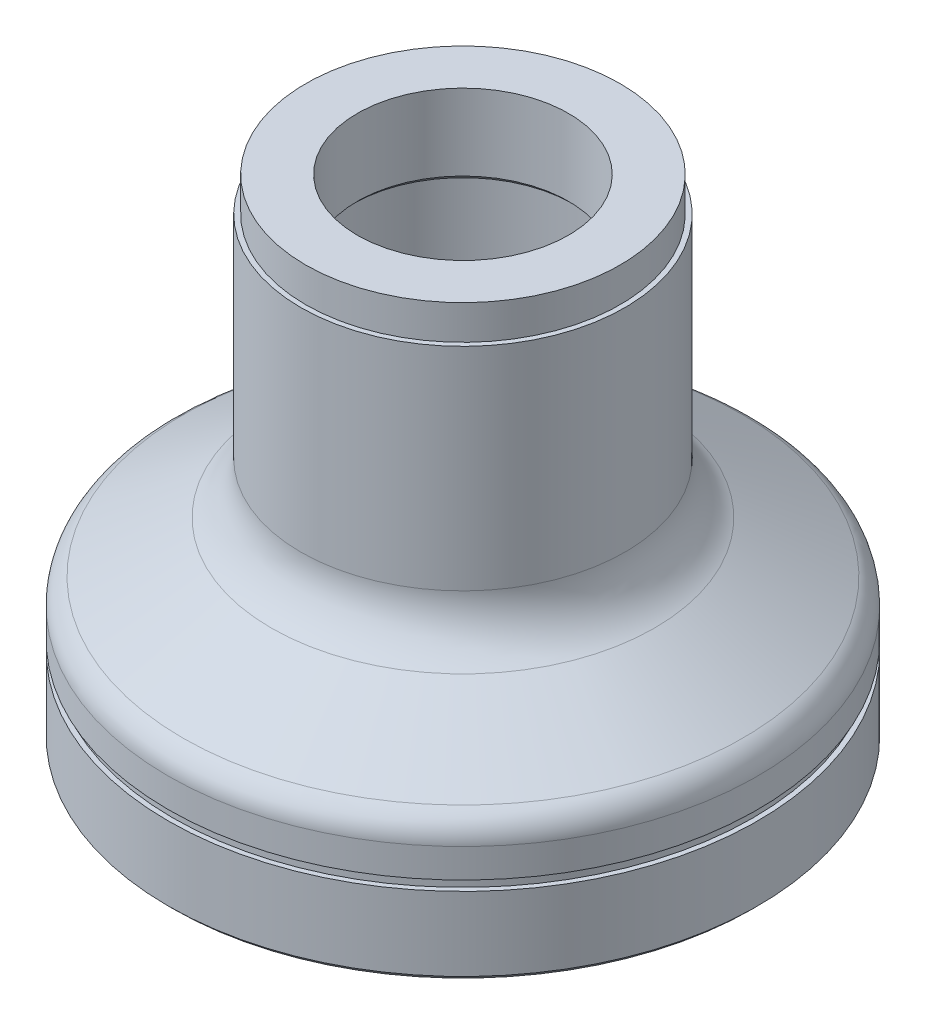
ISO-10303-21;
HEADER;
FILE_DESCRIPTION(('STEP AP214'),'2;1');
FILE_NAME('part.step','',(''),(''),'','','');
FILE_SCHEMA(('AUTOMOTIVE_DESIGN { 1 0 10303 214 1 1 1 1 }'));
ENDSEC;
DATA;
#1=APPLICATION_CONTEXT('core data for automotive mechanical design processes');
#2=APPLICATION_PROTOCOL_DEFINITION('international standard','automotive_design',2000,#1);
#3=PRODUCT_CONTEXT('',#1,'mechanical');
#4=PRODUCT('Part','Part','',(#3));
#5=PRODUCT_RELATED_PRODUCT_CATEGORY('part','',(#4));
#6=PRODUCT_DEFINITION_FORMATION('','',#4);
#7=PRODUCT_DEFINITION_CONTEXT('part definition',#1,'design');
#8=PRODUCT_DEFINITION('design','',#6,#7);
#9=PRODUCT_DEFINITION_SHAPE('','',#8);
#10=(LENGTH_UNIT() NAMED_UNIT(*) SI_UNIT(.MILLI.,.METRE.));
#11=(NAMED_UNIT(*) PLANE_ANGLE_UNIT() SI_UNIT($,.RADIAN.));
#12=(NAMED_UNIT(*) SI_UNIT($,.STERADIAN.) SOLID_ANGLE_UNIT());
#13=UNCERTAINTY_MEASURE_WITH_UNIT(LENGTH_MEASURE(1.E-05),#10,'distance_accuracy_value','');
#14=(GEOMETRIC_REPRESENTATION_CONTEXT(3) GLOBAL_UNCERTAINTY_ASSIGNED_CONTEXT((#13)) GLOBAL_UNIT_ASSIGNED_CONTEXT((#10,
#11,#12)) REPRESENTATION_CONTEXT('',''));
#15=CARTESIAN_POINT('',(0.,0.,0.));
#16=DIRECTION('',(0.,0.,1.));
#17=DIRECTION('',(1.,0.,0.));
#18=AXIS2_PLACEMENT_3D('',#15,#16,#17);
#19=CARTESIAN_POINT('',(0.,108.469301959884,0.));
#20=DIRECTION('',(0.,1.,0.));
#21=DIRECTION('',(0.,0.,1.));
#22=AXIS2_PLACEMENT_3D('',#19,#20,#21);
#23=CYLINDRICAL_SURFACE('',#22,21.5);
#24=CARTESIAN_POINT('',(0.,86.0350532872249,0.));
#25=DIRECTION('',(0.,1.,0.));
#26=DIRECTION('',(0.,0.,1.));
#27=AXIS2_PLACEMENT_3D('',#24,#25,#26);
#28=CIRCLE('',#27,21.5);
#29=CARTESIAN_POINT('',(0.,86.0350532872249,21.5));
#30=VERTEX_POINT('',#29);
#31=EDGE_CURVE('E10',#30,#30,#28,.T.);
#32=ORIENTED_EDGE('',*,*,#31,.F.);
#33=EDGE_LOOP('',(#32));
#34=FACE_BOUND('',#33,.T.);
#35=CARTESIAN_POINT('',(0.,101.535053287225,0.));
#36=DIRECTION('',(0.,1.,0.));
#37=DIRECTION('',(0.,0.,1.));
#38=AXIS2_PLACEMENT_3D('',#35,#36,#37);
#39=CIRCLE('',#38,21.5);
#40=CARTESIAN_POINT('',(0.,101.535053287225,21.5));
#41=VERTEX_POINT('',#40);
#42=EDGE_CURVE('E446',#41,#41,#39,.T.);
#43=ORIENTED_EDGE('',*,*,#42,.T.);
#44=EDGE_LOOP('',(#43));
#45=FACE_BOUND('',#44,.T.);
#46=ADVANCED_FACE('F346',(#34,#45),#23,.F.);
#47=CARTESIAN_POINT('',(0.,86.0350532872249,0.));
#48=DIRECTION('',(0.,-1.,0.));
#49=DIRECTION('',(0.,0.,-1.));
#50=AXIS2_PLACEMENT_3D('',#47,#48,#49);
#51=CONICAL_SURFACE('',#50,21.5,0.785398163397447);
#52=CARTESIAN_POINT('',(0.,85.0350532872249,0.));
#53=DIRECTION('',(0.,1.,0.));
#54=DIRECTION('',(0.,0.,1.));
#55=AXIS2_PLACEMENT_3D('',#52,#53,#54);
#56=CIRCLE('',#55,22.5);
#57=CARTESIAN_POINT('',(0.,85.0350532872249,22.5));
#58=VERTEX_POINT('',#57);
#59=EDGE_CURVE('E352',#58,#58,#56,.T.);
#60=ORIENTED_EDGE('',*,*,#59,.F.);
#61=EDGE_LOOP('',(#60));
#62=FACE_BOUND('',#61,.T.);
#63=ORIENTED_EDGE('',*,*,#31,.T.);
#64=EDGE_LOOP('',(#63));
#65=FACE_BOUND('',#64,.T.);
#66=ADVANCED_FACE('F627',(#62,#65),#51,.F.);
#67=CARTESIAN_POINT('',(22.5,85.0350532872249,0.));
#68=DIRECTION('',(0.,1.,0.));
#69=DIRECTION('',(0.,0.,1.));
#70=AXIS2_PLACEMENT_3D('',#67,#68,#69);
#71=PLANE('',#70);
#72=CARTESIAN_POINT('',(0.,85.0350532872249,0.));
#73=DIRECTION('',(0.,1.,0.));
#74=DIRECTION('',(0.,0.,1.));
#75=AXIS2_PLACEMENT_3D('',#72,#73,#74);
#76=CIRCLE('',#75,27.);
#77=CARTESIAN_POINT('',(0.,85.0350532872249,27.));
#78=VERTEX_POINT('',#77);
#79=EDGE_CURVE('E356',#78,#78,#76,.T.);
#80=ORIENTED_EDGE('',*,*,#79,.F.);
#81=EDGE_LOOP('',(#80));
#82=FACE_BOUND('',#81,.T.);
#83=ORIENTED_EDGE('',*,*,#59,.T.);
#84=EDGE_LOOP('',(#83));
#85=FACE_BOUND('',#84,.T.);
#86=ADVANCED_FACE('F622',(#82,#85),#71,.F.);
#87=CARTESIAN_POINT('',(0.,108.469301959884,0.));
#88=DIRECTION('',(0.,1.,0.));
#89=DIRECTION('',(0.,0.,1.));
#90=AXIS2_PLACEMENT_3D('',#87,#88,#89);
#91=CYLINDRICAL_SURFACE('',#90,27.);
#92=CARTESIAN_POINT('',(0.,32.8857243214734,0.));
#93=DIRECTION('',(0.,1.,0.));
#94=DIRECTION('',(0.,0.,1.));
#95=AXIS2_PLACEMENT_3D('',#92,#93,#94);
#96=CIRCLE('',#95,27.);
#97=CARTESIAN_POINT('',(0.,32.8857243214734,27.));
#98=VERTEX_POINT('',#97);
#99=EDGE_CURVE('E360',#98,#98,#96,.T.);
#100=ORIENTED_EDGE('',*,*,#99,.F.);
#101=EDGE_LOOP('',(#100));
#102=FACE_BOUND('',#101,.T.);
#103=ORIENTED_EDGE('',*,*,#79,.T.);
#104=EDGE_LOOP('',(#103));
#105=FACE_BOUND('',#104,.T.);
#106=ADVANCED_FACE('F616',(#102,#105),#91,.F.);
#107=CARTESIAN_POINT('',(0.,32.8857243214734,0.));
#108=DIRECTION('',(0.,-1.,0.));
#109=DIRECTION('',(0.,0.,-1.));
#110=AXIS2_PLACEMENT_3D('',#107,#108,#109);
#111=CONICAL_SURFACE('',#110,27.,0.785398163397448);
#112=CARTESIAN_POINT('',(0.,31.8857243214734,0.));
#113=DIRECTION('',(0.,1.,0.));
#114=DIRECTION('',(0.,0.,1.));
#115=AXIS2_PLACEMENT_3D('',#112,#113,#114);
#116=CIRCLE('',#115,28.);
#117=CARTESIAN_POINT('',(0.,31.8857243214734,28.));
#118=VERTEX_POINT('',#117);
#119=EDGE_CURVE('E365',#118,#118,#116,.T.);
#120=ORIENTED_EDGE('',*,*,#119,.F.);
#121=EDGE_LOOP('',(#120));
#122=FACE_BOUND('',#121,.T.);
#123=ORIENTED_EDGE('',*,*,#99,.T.);
#124=EDGE_LOOP('',(#123));
#125=FACE_BOUND('',#124,.T.);
#126=ADVANCED_FACE('F610',(#122,#125),#111,.F.);
#127=CARTESIAN_POINT('',(28.,31.8857243214734,0.));
#128=DIRECTION('',(0.,1.,0.));
#129=DIRECTION('',(0.,0.,1.));
#130=AXIS2_PLACEMENT_3D('',#127,#128,#129);
#131=PLANE('',#130);
#132=CARTESIAN_POINT('',(0.,31.8857243214734,0.));
#133=DIRECTION('',(0.,1.,0.));
#134=DIRECTION('',(0.,0.,1.));
#135=AXIS2_PLACEMENT_3D('',#132,#133,#134);
#136=CIRCLE('',#135,35.);
#137=CARTESIAN_POINT('',(0.,31.8857243214734,35.));
#138=VERTEX_POINT('',#137);
#139=EDGE_CURVE('E368',#138,#138,#136,.T.);
#140=ORIENTED_EDGE('',*,*,#139,.F.);
#141=EDGE_LOOP('',(#140));
#142=FACE_BOUND('',#141,.T.);
#143=ORIENTED_EDGE('',*,*,#119,.T.);
#144=EDGE_LOOP('',(#143));
#145=FACE_BOUND('',#144,.T.);
#146=ADVANCED_FACE('F604',(#142,#145),#131,.F.);
#147=CARTESIAN_POINT('',(0.,31.8857243214734,0.));
#148=DIRECTION('',(0.,1.,0.));
#149=DIRECTION('',(0.,0.,1.));
#150=AXIS2_PLACEMENT_3D('',#147,#148,#149);
#151=CONICAL_SURFACE('',#150,35.,0.314757661391322);
#152=CARTESIAN_POINT('',(0.,34.8060090877473,0.));
#153=DIRECTION('',(0.,1.,0.));
#154=DIRECTION('',(0.,0.,1.));
#155=AXIS2_PLACEMENT_3D('',#152,#153,#154);
#156=CIRCLE('',#155,35.9507903890195);
#157=CARTESIAN_POINT('',(0.,34.8060090877473,35.9507903890195));
#158=VERTEX_POINT('',#157);
#159=EDGE_CURVE('E371',#158,#158,#156,.T.);
#160=ORIENTED_EDGE('',*,*,#159,.F.);
#161=EDGE_LOOP('',(#160));
#162=FACE_BOUND('',#161,.T.);
#163=ORIENTED_EDGE('',*,*,#139,.T.);
#164=EDGE_LOOP('',(#163));
#165=FACE_BOUND('',#164,.T.);
#166=ADVANCED_FACE('F598',(#162,#165),#151,.T.);
#167=CARTESIAN_POINT('',(0.,34.1868369928257,0.));
#168=DIRECTION('',(0.,1.,0.));
#169=DIRECTION('',(0.,0.,1.));
#170=AXIS2_PLACEMENT_3D('',#167,#168,#169);
#171=TOROIDAL_SURFACE('',#170,37.8525332519928,1.99999999999996);
#172=CARTESIAN_POINT('',(0.,35.9188878003945,0.));
#173=DIRECTION('',(0.,1.,0.));
#174=DIRECTION('',(0.,0.,1.));
#175=AXIS2_PLACEMENT_3D('',#172,#173,#174);
#176=CIRCLE('',#175,38.8525332519929);
#177=CARTESIAN_POINT('',(0.,35.9188878003945,38.8525332519929));
#178=VERTEX_POINT('',#177);
#179=EDGE_CURVE('E374',#178,#178,#176,.T.);
#180=ORIENTED_EDGE('',*,*,#179,.F.);
#181=EDGE_LOOP('',(#180));
#182=FACE_BOUND('',#181,.T.);
#183=ORIENTED_EDGE('',*,*,#159,.T.);
#184=EDGE_LOOP('',(#183));
#185=FACE_BOUND('',#184,.T.);
#186=ADVANCED_FACE('F592',(#182,#185),#171,.F.);
#187=CARTESIAN_POINT('',(0.,35.9188878003945,0.));
#188=DIRECTION('',(0.,-1.,0.));
#189=DIRECTION('',(0.,0.,-1.));
#190=AXIS2_PLACEMENT_3D('',#187,#188,#189);
#191=CONICAL_SURFACE('',#190,38.8525332519929,1.0471975511966);
#192=CARTESIAN_POINT('',(0.,30.6250555325094,0.));
#193=DIRECTION('',(0.,1.,0.));
#194=DIRECTION('',(0.,0.,1.));
#195=AXIS2_PLACEMENT_3D('',#192,#193,#194);
#196=CIRCLE('',#195,48.0217197067176);
#197=CARTESIAN_POINT('',(0.,30.6250555325094,48.0217197067176));
#198=VERTEX_POINT('',#197);
#199=EDGE_CURVE('E377',#198,#198,#196,.T.);
#200=ORIENTED_EDGE('',*,*,#199,.F.);
#201=EDGE_LOOP('',(#200));
#202=FACE_BOUND('',#201,.T.);
#203=ORIENTED_EDGE('',*,*,#179,.T.);
#204=EDGE_LOOP('',(#203));
#205=FACE_BOUND('',#204,.T.);
#206=ADVANCED_FACE('F586',(#202,#205),#191,.F.);
#207=CARTESIAN_POINT('',(0.,28.8930047249405,0.));
#208=DIRECTION('',(0.,1.,0.));
#209=DIRECTION('',(0.,0.,1.));
#210=AXIS2_PLACEMENT_3D('',#207,#208,#209);
#211=TOROIDAL_SURFACE('',#210,47.0217197067175,2.00000000000003);
#212=CARTESIAN_POINT('',(0.,29.0350532872249,0.));
#213=DIRECTION('',(0.,1.,0.));
#214=DIRECTION('',(0.,0.,1.));
#215=AXIS2_PLACEMENT_3D('',#212,#213,#214);
#216=CIRCLE('',#215,49.0166688804944);
#217=CARTESIAN_POINT('',(0.,29.0350532872249,49.0166688804944));
#218=VERTEX_POINT('',#217);
#219=EDGE_CURVE('E380',#218,#218,#216,.T.);
#220=ORIENTED_EDGE('',*,*,#219,.F.);
#221=EDGE_LOOP('',(#220));
#222=FACE_BOUND('',#221,.T.);
#223=ORIENTED_EDGE('',*,*,#199,.T.);
#224=EDGE_LOOP('',(#223));
#225=FACE_BOUND('',#224,.T.);
#226=ADVANCED_FACE('F580',(#222,#225),#211,.F.);
#227=CARTESIAN_POINT('',(50.,29.035053287225,0.));
#228=DIRECTION('',(0.,1.,0.));
#229=DIRECTION('',(0.,0.,1.));
#230=AXIS2_PLACEMENT_3D('',#227,#228,#229);
#231=PLANE('',#230);
#232=CARTESIAN_POINT('',(0.,29.0350532872251,0.));
#233=DIRECTION('',(0.,1.,0.));
#234=DIRECTION('',(0.,0.,1.));
#235=AXIS2_PLACEMENT_3D('',#232,#233,#234);
#236=CIRCLE('',#235,50.);
#237=CARTESIAN_POINT('',(0.,29.0350532872251,50.));
#238=VERTEX_POINT('',#237);
#239=EDGE_CURVE('E383',#238,#238,#236,.T.);
#240=ORIENTED_EDGE('',*,*,#239,.F.);
#241=EDGE_LOOP('',(#240));
#242=FACE_BOUND('',#241,.T.);
#243=ORIENTED_EDGE('',*,*,#219,.T.);
#244=EDGE_LOOP('',(#243));
#245=FACE_BOUND('',#244,.T.);
#246=ADVANCED_FACE('F574',(#242,#245),#231,.F.);
#247=CARTESIAN_POINT('',(0.,108.469301959884,0.));
#248=DIRECTION('',(0.,1.,0.));
#249=DIRECTION('',(0.,0.,1.));
#250=AXIS2_PLACEMENT_3D('',#247,#248,#249);
#251=CYLINDRICAL_SURFACE('',#250,50.0000000000001);
#252=CARTESIAN_POINT('',(0.,27.0350532872251,0.));
#253=DIRECTION('',(0.,1.,0.));
#254=DIRECTION('',(0.,0.,1.));
#255=AXIS2_PLACEMENT_3D('',#252,#253,#254);
#256=CIRCLE('',#255,50.0000000000001);
#257=CARTESIAN_POINT('',(0.,27.0350532872251,50.0000000000001));
#258=VERTEX_POINT('',#257);
#259=EDGE_CURVE('E386',#258,#258,#256,.T.);
#260=ORIENTED_EDGE('',*,*,#259,.F.);
#261=EDGE_LOOP('',(#260));
#262=FACE_BOUND('',#261,.T.);
#263=ORIENTED_EDGE('',*,*,#239,.T.);
#264=EDGE_LOOP('',(#263));
#265=FACE_BOUND('',#264,.T.);
#266=ADVANCED_FACE('F568',(#262,#265),#251,.F.);
#267=CARTESIAN_POINT('',(55.,27.0350532872251,0.));
#268=DIRECTION('',(0.,1.,0.));
#269=DIRECTION('',(0.,0.,1.));
#270=AXIS2_PLACEMENT_3D('',#267,#268,#269);
#271=PLANE('',#270);
#272=CARTESIAN_POINT('',(0.,27.0350532872251,0.));
#273=DIRECTION('',(0.,1.,0.));
#274=DIRECTION('',(0.,0.,1.));
#275=AXIS2_PLACEMENT_3D('',#272,#273,#274);
#276=CIRCLE('',#275,55.);
#277=CARTESIAN_POINT('',(0.,27.0350532872251,55.));
#278=VERTEX_POINT('',#277);
#279=EDGE_CURVE('E389',#278,#278,#276,.T.);
#280=ORIENTED_EDGE('',*,*,#279,.F.);
#281=EDGE_LOOP('',(#280));
#282=FACE_BOUND('',#281,.T.);
#283=ORIENTED_EDGE('',*,*,#259,.T.);
#284=EDGE_LOOP('',(#283));
#285=FACE_BOUND('',#284,.T.);
#286=ADVANCED_FACE('F562',(#282,#285),#271,.F.);
#287=CARTESIAN_POINT('',(0.,108.469301959884,0.));
#288=DIRECTION('',(0.,1.,0.));
#289=DIRECTION('',(0.,0.,1.));
#290=AXIS2_PLACEMENT_3D('',#287,#288,#289);
#291=CYLINDRICAL_SURFACE('',#290,55.);
#292=CARTESIAN_POINT('',(0.,24.5350532872251,0.));
#293=DIRECTION('',(0.,1.,0.));
#294=DIRECTION('',(0.,0.,1.));
#295=AXIS2_PLACEMENT_3D('',#292,#293,#294);
#296=CIRCLE('',#295,55.);
#297=CARTESIAN_POINT('',(0.,24.5350532872251,55.));
#298=VERTEX_POINT('',#297);
#299=EDGE_CURVE('E392',#298,#298,#296,.T.);
#300=ORIENTED_EDGE('',*,*,#299,.F.);
#301=EDGE_LOOP('',(#300));
#302=FACE_BOUND('',#301,.T.);
#303=ORIENTED_EDGE('',*,*,#279,.T.);
#304=EDGE_LOOP('',(#303));
#305=FACE_BOUND('',#304,.T.);
#306=ADVANCED_FACE('F556',(#302,#305),#291,.F.);
#307=CARTESIAN_POINT('',(49.,24.5350532872251,0.));
#308=DIRECTION('',(0.,-1.,0.));
#309=DIRECTION('',(0.,0.,-1.));
#310=AXIS2_PLACEMENT_3D('',#307,#308,#309);
#311=PLANE('',#310);
#312=CARTESIAN_POINT('',(0.,24.5350532872251,0.));
#313=DIRECTION('',(0.,1.,0.));
#314=DIRECTION('',(0.,0.,1.));
#315=AXIS2_PLACEMENT_3D('',#312,#313,#314);
#316=CIRCLE('',#315,49.);
#317=CARTESIAN_POINT('',(0.,24.5350532872251,49.));
#318=VERTEX_POINT('',#317);
#319=EDGE_CURVE('E395',#318,#318,#316,.T.);
#320=ORIENTED_EDGE('',*,*,#319,.F.);
#321=EDGE_LOOP('',(#320));
#322=FACE_BOUND('',#321,.T.);
#323=ORIENTED_EDGE('',*,*,#299,.T.);
#324=EDGE_LOOP('',(#323));
#325=FACE_BOUND('',#324,.T.);
#326=ADVANCED_FACE('F550',(#322,#325),#311,.F.);
#327=CARTESIAN_POINT('',(0.,108.469301959884,0.));
#328=DIRECTION('',(0.,1.,0.));
#329=DIRECTION('',(0.,0.,1.));
#330=AXIS2_PLACEMENT_3D('',#327,#328,#329);
#331=CYLINDRICAL_SURFACE('',#330,49.);
#332=CARTESIAN_POINT('',(0.,6.53505328722506,0.));
#333=DIRECTION('',(0.,1.,0.));
#334=DIRECTION('',(0.,0.,1.));
#335=AXIS2_PLACEMENT_3D('',#332,#333,#334);
#336=CIRCLE('',#335,49.);
#337=CARTESIAN_POINT('',(0.,6.53505328722506,49.));
#338=VERTEX_POINT('',#337);
#339=EDGE_CURVE('E398',#338,#338,#336,.T.);
#340=ORIENTED_EDGE('',*,*,#339,.F.);
#341=EDGE_LOOP('',(#340));
#342=FACE_BOUND('',#341,.T.);
#343=ORIENTED_EDGE('',*,*,#319,.T.);
#344=EDGE_LOOP('',(#343));
#345=FACE_BOUND('',#344,.T.);
#346=ADVANCED_FACE('F544',(#342,#345),#331,.F.);
#347=CARTESIAN_POINT('',(57.,6.53505328722507,0.));
#348=DIRECTION('',(0.,1.,0.));
#349=DIRECTION('',(0.,0.,1.));
#350=AXIS2_PLACEMENT_3D('',#347,#348,#349);
#351=PLANE('',#350);
#352=CARTESIAN_POINT('',(0.,6.53505328722508,0.));
#353=DIRECTION('',(0.,1.,0.));
#354=DIRECTION('',(0.,0.,1.));
#355=AXIS2_PLACEMENT_3D('',#352,#353,#354);
#356=CIRCLE('',#355,57.);
#357=CARTESIAN_POINT('',(0.,6.53505328722508,57.));
#358=VERTEX_POINT('',#357);
#359=EDGE_CURVE('E401',#358,#358,#356,.T.);
#360=ORIENTED_EDGE('',*,*,#359,.F.);
#361=EDGE_LOOP('',(#360));
#362=FACE_BOUND('',#361,.T.);
#363=ORIENTED_EDGE('',*,*,#339,.T.);
#364=EDGE_LOOP('',(#363));
#365=FACE_BOUND('',#364,.T.);
#366=ADVANCED_FACE('F538',(#362,#365),#351,.F.);
#367=CARTESIAN_POINT('',(0.,108.469301959884,0.));
#368=DIRECTION('',(0.,1.,0.));
#369=DIRECTION('',(0.,0.,1.));
#370=AXIS2_PLACEMENT_3D('',#367,#368,#369);
#371=CYLINDRICAL_SURFACE('',#370,57.);
#372=CARTESIAN_POINT('',(0.,1.53505328722507,0.));
#373=DIRECTION('',(0.,1.,0.));
#374=DIRECTION('',(0.,0.,1.));
#375=AXIS2_PLACEMENT_3D('',#372,#373,#374);
#376=CIRCLE('',#375,57.);
#377=CARTESIAN_POINT('',(0.,1.53505328722507,57.));
#378=VERTEX_POINT('',#377);
#379=EDGE_CURVE('E404',#378,#378,#376,.T.);
#380=ORIENTED_EDGE('',*,*,#379,.F.);
#381=EDGE_LOOP('',(#380));
#382=FACE_BOUND('',#381,.T.);
#383=ORIENTED_EDGE('',*,*,#359,.T.);
#384=EDGE_LOOP('',(#383));
#385=FACE_BOUND('',#384,.T.);
#386=ADVANCED_FACE('F532',(#382,#385),#371,.F.);
#387=CARTESIAN_POINT('',(57.,1.53505328722523,0.));
#388=DIRECTION('',(0.,1.,0.));
#389=DIRECTION('',(0.,0.,1.));
#390=AXIS2_PLACEMENT_3D('',#387,#388,#389);
#391=PLANE('',#390);
#392=CARTESIAN_POINT('',(0.,1.53505328722538,0.));
#393=DIRECTION('',(0.,1.,0.));
#394=DIRECTION('',(0.,0.,1.));
#395=AXIS2_PLACEMENT_3D('',#392,#393,#394);
#396=CIRCLE('',#395,59.);
#397=CARTESIAN_POINT('',(0.,1.53505328722538,59.));
#398=VERTEX_POINT('',#397);
#399=EDGE_CURVE('E407',#398,#398,#396,.T.);
#400=ORIENTED_EDGE('',*,*,#399,.F.);
#401=EDGE_LOOP('',(#400));
#402=FACE_BOUND('',#401,.T.);
#403=ORIENTED_EDGE('',*,*,#379,.T.);
#404=EDGE_LOOP('',(#403));
#405=FACE_BOUND('',#404,.T.);
#406=ADVANCED_FACE('F526',(#402,#405),#391,.F.);
#407=CARTESIAN_POINT('',(0.,1.53505328722538,0.));
#408=DIRECTION('',(0.,1.,0.));
#409=DIRECTION('',(0.,0.,1.));
#410=AXIS2_PLACEMENT_3D('',#407,#408,#409);
#411=CONICAL_SURFACE('',#410,59.,0.785398163397428);
#412=CARTESIAN_POINT('',(0.,2.53505328722542,0.));
#413=DIRECTION('',(0.,1.,0.));
#414=DIRECTION('',(0.,0.,1.));
#415=AXIS2_PLACEMENT_3D('',#412,#413,#414);
#416=CIRCLE('',#415,60.);
#417=CARTESIAN_POINT('',(0.,2.53505328722542,60.));
#418=VERTEX_POINT('',#417);
#419=EDGE_CURVE('E410',#418,#418,#416,.T.);
#420=ORIENTED_EDGE('',*,*,#419,.F.);
#421=EDGE_LOOP('',(#420));
#422=FACE_BOUND('',#421,.T.);
#423=ORIENTED_EDGE('',*,*,#399,.T.);
#424=EDGE_LOOP('',(#423));
#425=FACE_BOUND('',#424,.T.);
#426=ADVANCED_FACE('F520',(#422,#425),#411,.T.);
#427=CARTESIAN_POINT('',(0.,108.469301959884,0.));
#428=DIRECTION('',(0.,1.,0.));
#429=DIRECTION('',(0.,0.,1.));
#430=AXIS2_PLACEMENT_3D('',#427,#428,#429);
#431=CYLINDRICAL_SURFACE('',#430,60.);
#432=CARTESIAN_POINT('',(0.,17.5350532872251,0.));
#433=DIRECTION('',(0.,1.,0.));
#434=DIRECTION('',(0.,0.,1.));
#435=AXIS2_PLACEMENT_3D('',#432,#433,#434);
#436=CIRCLE('',#435,60.);
#437=CARTESIAN_POINT('',(0.,17.5350532872251,60.));
#438=VERTEX_POINT('',#437);
#439=EDGE_CURVE('E413',#438,#438,#436,.T.);
#440=ORIENTED_EDGE('',*,*,#439,.F.);
#441=EDGE_LOOP('',(#440));
#442=FACE_BOUND('',#441,.T.);
#443=ORIENTED_EDGE('',*,*,#419,.T.);
#444=EDGE_LOOP('',(#443));
#445=FACE_BOUND('',#444,.T.);
#446=ADVANCED_FACE('F514',(#442,#445),#431,.T.);
#447=CARTESIAN_POINT('',(59.,17.535053287225,0.));
#448=DIRECTION('',(0.,-1.,0.));
#449=DIRECTION('',(0.,0.,-1.));
#450=AXIS2_PLACEMENT_3D('',#447,#448,#449);
#451=PLANE('',#450);
#452=CARTESIAN_POINT('',(0.,17.535053287225,0.));
#453=DIRECTION('',(0.,1.,0.));
#454=DIRECTION('',(0.,0.,1.));
#455=AXIS2_PLACEMENT_3D('',#452,#453,#454);
#456=CIRCLE('',#455,59.);
#457=CARTESIAN_POINT('',(0.,17.535053287225,59.));
#458=VERTEX_POINT('',#457);
#459=EDGE_CURVE('E416',#458,#458,#456,.T.);
#460=ORIENTED_EDGE('',*,*,#459,.F.);
#461=EDGE_LOOP('',(#460));
#462=FACE_BOUND('',#461,.T.);
#463=ORIENTED_EDGE('',*,*,#439,.T.);
#464=EDGE_LOOP('',(#463));
#465=FACE_BOUND('',#464,.T.);
#466=ADVANCED_FACE('F508',(#462,#465),#451,.F.);
#467=CARTESIAN_POINT('',(0.,108.469301959884,0.));
#468=DIRECTION('',(0.,1.,0.));
#469=DIRECTION('',(0.,0.,1.));
#470=AXIS2_PLACEMENT_3D('',#467,#468,#469);
#471=CYLINDRICAL_SURFACE('',#470,59.);
#472=CARTESIAN_POINT('',(0.,19.535053287225,0.));
#473=DIRECTION('',(0.,1.,0.));
#474=DIRECTION('',(0.,0.,1.));
#475=AXIS2_PLACEMENT_3D('',#472,#473,#474);
#476=CIRCLE('',#475,59.);
#477=CARTESIAN_POINT('',(0.,19.535053287225,59.));
#478=VERTEX_POINT('',#477);
#479=EDGE_CURVE('E419',#478,#478,#476,.T.);
#480=ORIENTED_EDGE('',*,*,#479,.F.);
#481=EDGE_LOOP('',(#480));
#482=FACE_BOUND('',#481,.T.);
#483=ORIENTED_EDGE('',*,*,#459,.T.);
#484=EDGE_LOOP('',(#483));
#485=FACE_BOUND('',#484,.T.);
#486=ADVANCED_FACE('F502',(#482,#485),#471,.T.);
#487=CARTESIAN_POINT('',(60.,19.535053287225,0.));
#488=DIRECTION('',(0.,1.,0.));
#489=DIRECTION('',(0.,0.,1.));
#490=AXIS2_PLACEMENT_3D('',#487,#488,#489);
#491=PLANE('',#490);
#492=CARTESIAN_POINT('',(0.,19.5350532872251,0.));
#493=DIRECTION('',(0.,1.,0.));
#494=DIRECTION('',(0.,0.,1.));
#495=AXIS2_PLACEMENT_3D('',#492,#493,#494);
#496=CIRCLE('',#495,60.);
#497=CARTESIAN_POINT('',(0.,19.5350532872251,60.));
#498=VERTEX_POINT('',#497);
#499=EDGE_CURVE('E422',#498,#498,#496,.T.);
#500=ORIENTED_EDGE('',*,*,#499,.F.);
#501=EDGE_LOOP('',(#500));
#502=FACE_BOUND('',#501,.T.);
#503=ORIENTED_EDGE('',*,*,#479,.T.);
#504=EDGE_LOOP('',(#503));
#505=FACE_BOUND('',#504,.T.);
#506=ADVANCED_FACE('F496',(#502,#505),#491,.F.);
#507=CARTESIAN_POINT('',(0.,108.469301959884,0.));
#508=DIRECTION('',(0.,1.,0.));
#509=DIRECTION('',(0.,0.,1.));
#510=AXIS2_PLACEMENT_3D('',#507,#508,#509);
#511=CYLINDRICAL_SURFACE('',#510,60.);
#512=CARTESIAN_POINT('',(0.,25.4414429883229,0.));
#513=DIRECTION('',(0.,1.,0.));
#514=DIRECTION('',(0.,0.,1.));
#515=AXIS2_PLACEMENT_3D('',#512,#513,#514);
#516=CIRCLE('',#515,60.);
#517=CARTESIAN_POINT('',(0.,25.4414429883229,60.));
#518=VERTEX_POINT('',#517);
#519=EDGE_CURVE('E425',#518,#518,#516,.T.);
#520=ORIENTED_EDGE('',*,*,#519,.F.);
#521=EDGE_LOOP('',(#520));
#522=FACE_BOUND('',#521,.T.);
#523=ORIENTED_EDGE('',*,*,#499,.T.);
#524=EDGE_LOOP('',(#523));
#525=FACE_BOUND('',#524,.T.);
#526=ADVANCED_FACE('F490',(#522,#525),#511,.T.);
#527=CARTESIAN_POINT('',(0.,25.4414429883229,0.));
#528=DIRECTION('',(0.,1.,0.));
#529=DIRECTION('',(0.,0.,1.));
#530=AXIS2_PLACEMENT_3D('',#527,#528,#529);
#531=TOROIDAL_SURFACE('',#530,54.,6.);
#532=CARTESIAN_POINT('',(0.,30.6375954110295,0.));
#533=DIRECTION('',(0.,1.,0.));
#534=DIRECTION('',(0.,0.,1.));
#535=AXIS2_PLACEMENT_3D('',#532,#533,#534);
#536=CIRCLE('',#535,57.);
#537=CARTESIAN_POINT('',(0.,30.6375954110295,57.));
#538=VERTEX_POINT('',#537);
#539=EDGE_CURVE('E428',#538,#538,#536,.T.);
#540=ORIENTED_EDGE('',*,*,#539,.F.);
#541=EDGE_LOOP('',(#540));
#542=FACE_BOUND('',#541,.T.);
#543=ORIENTED_EDGE('',*,*,#519,.T.);
#544=EDGE_LOOP('',(#543));
#545=FACE_BOUND('',#544,.T.);
#546=ADVANCED_FACE('F484',(#542,#545),#531,.T.);
#547=CARTESIAN_POINT('',(0.,30.6375954110295,0.));
#548=DIRECTION('',(0.,-1.,0.));
#549=DIRECTION('',(0.,0.,-1.));
#550=AXIS2_PLACEMENT_3D('',#547,#548,#549);
#551=CONICAL_SURFACE('',#550,57.,1.0471975511966);
#552=CARTESIAN_POINT('',(0.,41.0299002564427,0.));
#553=DIRECTION('',(0.,1.,0.));
#554=DIRECTION('',(0.,0.,1.));
#555=AXIS2_PLACEMENT_3D('',#552,#553,#554);
#556=CIRCLE('',#555,39.);
#557=CARTESIAN_POINT('',(0.,41.0299002564427,39.));
#558=VERTEX_POINT('',#557);
#559=EDGE_CURVE('E431',#558,#558,#556,.T.);
#560=ORIENTED_EDGE('',*,*,#559,.F.);
#561=EDGE_LOOP('',(#560));
#562=FACE_BOUND('',#561,.T.);
#563=ORIENTED_EDGE('',*,*,#539,.T.);
#564=EDGE_LOOP('',(#563));
#565=FACE_BOUND('',#564,.T.);
#566=ADVANCED_FACE('F478',(#562,#565),#551,.T.);
#567=CARTESIAN_POINT('',(0.,51.422205101856,0.));
#568=DIRECTION('',(0.,1.,0.));
#569=DIRECTION('',(0.,0.,1.));
#570=AXIS2_PLACEMENT_3D('',#567,#568,#569);
#571=TOROIDAL_SURFACE('',#570,45.,12.);
#572=CARTESIAN_POINT('',(0.,51.422205101856,0.));
#573=DIRECTION('',(0.,1.,0.));
#574=DIRECTION('',(0.,0.,1.));
#575=AXIS2_PLACEMENT_3D('',#572,#573,#574);
#576=CIRCLE('',#575,33.);
#577=CARTESIAN_POINT('',(0.,51.422205101856,33.));
#578=VERTEX_POINT('',#577);
#579=EDGE_CURVE('E434',#578,#578,#576,.T.);
#580=ORIENTED_EDGE('',*,*,#579,.F.);
#581=EDGE_LOOP('',(#580));
#582=FACE_BOUND('',#581,.T.);
#583=ORIENTED_EDGE('',*,*,#559,.T.);
#584=EDGE_LOOP('',(#583));
#585=FACE_BOUND('',#584,.T.);
#586=ADVANCED_FACE('F472',(#582,#585),#571,.F.);
#587=CARTESIAN_POINT('',(0.,108.469301959884,0.));
#588=DIRECTION('',(0.,1.,0.));
#589=DIRECTION('',(0.,0.,1.));
#590=AXIS2_PLACEMENT_3D('',#587,#588,#589);
#591=CYLINDRICAL_SURFACE('',#590,33.);
#592=CARTESIAN_POINT('',(0.,94.5350532872251,0.));
#593=DIRECTION('',(0.,1.,0.));
#594=DIRECTION('',(0.,0.,1.));
#595=AXIS2_PLACEMENT_3D('',#592,#593,#594);
#596=CIRCLE('',#595,33.);
#597=CARTESIAN_POINT('',(0.,94.5350532872251,33.));
#598=VERTEX_POINT('',#597);
#599=EDGE_CURVE('E437',#598,#598,#596,.T.);
#600=ORIENTED_EDGE('',*,*,#599,.F.);
#601=EDGE_LOOP('',(#600));
#602=FACE_BOUND('',#601,.T.);
#603=ORIENTED_EDGE('',*,*,#579,.T.);
#604=EDGE_LOOP('',(#603));
#605=FACE_BOUND('',#604,.T.);
#606=ADVANCED_FACE('F466',(#602,#605),#591,.T.);
#607=CARTESIAN_POINT('',(32.,94.5350532872251,0.));
#608=DIRECTION('',(0.,-1.,0.));
#609=DIRECTION('',(0.,0.,-1.));
#610=AXIS2_PLACEMENT_3D('',#607,#608,#609);
#611=PLANE('',#610);
#612=CARTESIAN_POINT('',(0.,94.5350532872251,0.));
#613=DIRECTION('',(0.,1.,0.));
#614=DIRECTION('',(0.,0.,1.));
#615=AXIS2_PLACEMENT_3D('',#612,#613,#614);
#616=CIRCLE('',#615,32.);
#617=CARTESIAN_POINT('',(0.,94.5350532872251,32.));
#618=VERTEX_POINT('',#617);
#619=EDGE_CURVE('E440',#618,#618,#616,.T.);
#620=ORIENTED_EDGE('',*,*,#619,.F.);
#621=EDGE_LOOP('',(#620));
#622=FACE_BOUND('',#621,.T.);
#623=ORIENTED_EDGE('',*,*,#599,.T.);
#624=EDGE_LOOP('',(#623));
#625=FACE_BOUND('',#624,.T.);
#626=ADVANCED_FACE('F460',(#622,#625),#611,.F.);
#627=CARTESIAN_POINT('',(0.,108.469301959884,0.));
#628=DIRECTION('',(0.,1.,0.));
#629=DIRECTION('',(0.,0.,1.));
#630=AXIS2_PLACEMENT_3D('',#627,#628,#629);
#631=CYLINDRICAL_SURFACE('',#630,32.);
#632=CARTESIAN_POINT('',(0.,101.535053287225,0.));
#633=DIRECTION('',(0.,1.,0.));
#634=DIRECTION('',(0.,0.,1.));
#635=AXIS2_PLACEMENT_3D('',#632,#633,#634);
#636=CIRCLE('',#635,32.);
#637=CARTESIAN_POINT('',(0.,101.535053287225,32.));
#638=VERTEX_POINT('',#637);
#639=EDGE_CURVE('E443',#638,#638,#636,.T.);
#640=ORIENTED_EDGE('',*,*,#639,.F.);
#641=EDGE_LOOP('',(#640));
#642=FACE_BOUND('',#641,.T.);
#643=ORIENTED_EDGE('',*,*,#619,.T.);
#644=EDGE_LOOP('',(#643));
#645=FACE_BOUND('',#644,.T.);
#646=ADVANCED_FACE('F454',(#642,#645),#631,.T.);
#647=CARTESIAN_POINT('',(21.5,101.535053287225,0.));
#648=DIRECTION('',(0.,-1.,0.));
#649=DIRECTION('',(0.,0.,-1.));
#650=AXIS2_PLACEMENT_3D('',#647,#648,#649);
#651=PLANE('',#650);
#652=ORIENTED_EDGE('',*,*,#42,.F.);
#653=EDGE_LOOP('',(#652));
#654=FACE_BOUND('',#653,.T.);
#655=ORIENTED_EDGE('',*,*,#639,.T.);
#656=EDGE_LOOP('',(#655));
#657=FACE_BOUND('',#656,.T.);
#658=ADVANCED_FACE('F451',(#654,#657),#651,.F.);
#659=CLOSED_SHELL('',(#46,#66,#86,#106,#126,#146,#166,#186,#206,#226,#246,#266,#286,#306,#326,
#346,#366,#386,#406,#426,#446,#466,#486,#506,#526,#546,#566,#586,#606,#626,#646,#658));
#660=MANIFOLD_SOLID_BREP('B2',#659);
#661=ADVANCED_BREP_SHAPE_REPRESENTATION('',(#18,#660),#14);
#662=SHAPE_DEFINITION_REPRESENTATION(#9,#661);
ENDSEC;
END-ISO-10303-21;
